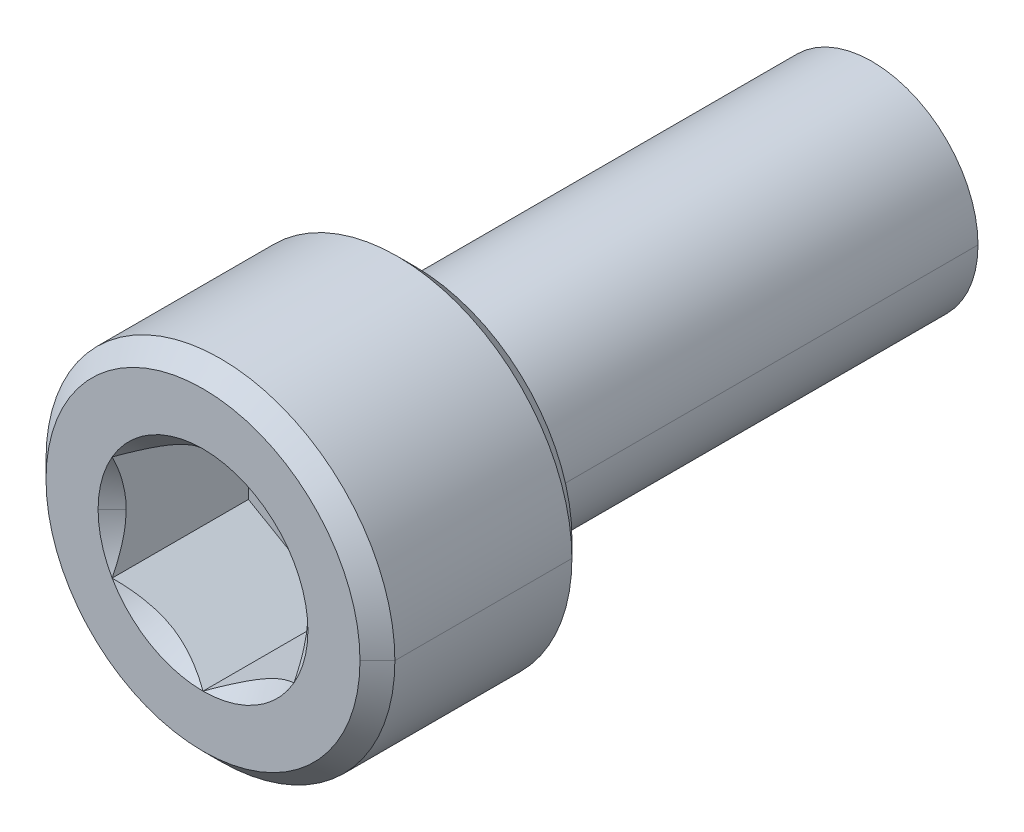
ISO-10303-21;
HEADER;
FILE_DESCRIPTION(('STEP AP214'),'2;1');
FILE_NAME('part.step','',(''),(''),'','','');
FILE_SCHEMA(('AUTOMOTIVE_DESIGN { 1 0 10303 214 1 1 1 1 }'));
ENDSEC;
DATA;
#1=APPLICATION_CONTEXT('core data for automotive mechanical design processes');
#2=APPLICATION_PROTOCOL_DEFINITION('international standard','automotive_design',2000,#1);
#3=PRODUCT_CONTEXT('',#1,'mechanical');
#4=PRODUCT('Part','Part','',(#3));
#5=PRODUCT_RELATED_PRODUCT_CATEGORY('part','',(#4));
#6=PRODUCT_DEFINITION_FORMATION('','',#4);
#7=PRODUCT_DEFINITION_CONTEXT('part definition',#1,'design');
#8=PRODUCT_DEFINITION('design','',#6,#7);
#9=PRODUCT_DEFINITION_SHAPE('','',#8);
#10=(LENGTH_UNIT() NAMED_UNIT(*) SI_UNIT(.MILLI.,.METRE.));
#11=(NAMED_UNIT(*) PLANE_ANGLE_UNIT() SI_UNIT($,.RADIAN.));
#12=(NAMED_UNIT(*) SI_UNIT($,.STERADIAN.) SOLID_ANGLE_UNIT());
#13=UNCERTAINTY_MEASURE_WITH_UNIT(LENGTH_MEASURE(1.E-05),#10,'distance_accuracy_value','');
#14=(GEOMETRIC_REPRESENTATION_CONTEXT(3) GLOBAL_UNCERTAINTY_ASSIGNED_CONTEXT((#13)) GLOBAL_UNIT_ASSIGNED_CONTEXT((#10,
#11,#12)) REPRESENTATION_CONTEXT('',''));
#15=CARTESIAN_POINT('',(0.,0.,0.));
#16=DIRECTION('',(0.,0.,1.));
#17=DIRECTION('',(1.,0.,0.));
#18=AXIS2_PLACEMENT_3D('',#15,#16,#17);
#19=CARTESIAN_POINT('',(-10.3682102585368,0.,2.8429));
#20=DIRECTION('',(0.,0.,1.));
#21=DIRECTION('',(-1.,0.,0.));
#22=AXIS2_PLACEMENT_3D('',#19,#20,#21);
#23=CONICAL_SURFACE('',#22,3.429,0.785398163397452);
#24=DIRECTION('',(0.70710678118655,0.,0.707106781186545));
#25=VECTOR('',#24,1.);
#26=CARTESIAN_POINT('',(-6.9392102585368,0.,2.8429));
#27=LINE('',#26,#25);
#28=CARTESIAN_POINT('',(-7.2821102585268,0.,2.50000000001));
#29=VERTEX_POINT('',#28);
#30=CARTESIAN_POINT('',(-6.9392102585268,0.,2.84290000001));
#31=VERTEX_POINT('',#30);
#32=EDGE_CURVE('E230',#29,#31,#27,.T.);
#33=ORIENTED_EDGE('',*,*,#32,.F.);
#34=CARTESIAN_POINT('',(-10.3682102585368,0.,2.50000000001));
#35=DIRECTION('',(0.,0.,-1.));
#36=DIRECTION('',(-1.,0.,0.));
#37=AXIS2_PLACEMENT_3D('',#34,#35,#36);
#38=CIRCLE('',#37,3.08610000001);
#39=CARTESIAN_POINT('',(-13.4543102585468,0.,2.50000000001));
#40=VERTEX_POINT('',#39);
#41=EDGE_CURVE('E235',#40,#29,#38,.T.);
#42=ORIENTED_EDGE('',*,*,#41,.F.);
#43=DIRECTION('',(-0.70710678118655,0.,0.707106781186545));
#44=VECTOR('',#43,1.);
#45=CARTESIAN_POINT('',(-13.7972102585368,0.,2.8429));
#46=LINE('',#45,#44);
#47=CARTESIAN_POINT('',(-13.7972102585468,0.,2.84290000001));
#48=VERTEX_POINT('',#47);
#49=EDGE_CURVE('E249',#40,#48,#46,.T.);
#50=ORIENTED_EDGE('',*,*,#49,.T.);
#51=CARTESIAN_POINT('',(-10.3682102585368,0.,2.84290000001));
#52=DIRECTION('',(0.,0.,1.));
#53=DIRECTION('',(-1.,0.,0.));
#54=AXIS2_PLACEMENT_3D('',#51,#52,#53);
#55=CIRCLE('',#54,3.42900000001);
#56=EDGE_CURVE('E11',#31,#48,#55,.T.);
#57=ORIENTED_EDGE('',*,*,#56,.F.);
#58=EDGE_LOOP('',(#33,#42,#50,#57));
#59=FACE_BOUND('',#58,.T.);
#60=ADVANCED_FACE('F17',(#59),#23,.T.);
#61=CARTESIAN_POINT('',(-10.3682102585368,0.,6.6656));
#62=DIRECTION('',(0.,0.,-1.));
#63=DIRECTION('',(1.,0.,0.));
#64=AXIS2_PLACEMENT_3D('',#61,#62,#63);
#65=CONICAL_SURFACE('',#64,3.0861,0.785398163397446);
#66=DIRECTION('',(-0.707106781186546,0.,-0.707106781186549));
#67=VECTOR('',#66,1.);
#68=CARTESIAN_POINT('',(-13.4543102585368,0.,6.6656));
#69=LINE('',#68,#67);
#70=CARTESIAN_POINT('',(-13.4543102585468,0.,6.66560000001));
#71=VERTEX_POINT('',#70);
#72=CARTESIAN_POINT('',(-13.7972102585468,0.,6.32270000001));
#73=VERTEX_POINT('',#72);
#74=EDGE_CURVE('E266',#71,#73,#69,.T.);
#75=ORIENTED_EDGE('',*,*,#74,.F.);
#76=CARTESIAN_POINT('',(-10.3682102585368,0.,6.66560000001));
#77=DIRECTION('',(0.,0.,1.));
#78=DIRECTION('',(-1.,0.,0.));
#79=AXIS2_PLACEMENT_3D('',#76,#77,#78);
#80=CIRCLE('',#79,3.08610000001001);
#81=CARTESIAN_POINT('',(-7.28211025852679,0.,6.66560000001));
#82=VERTEX_POINT('',#81);
#83=EDGE_CURVE('E262',#82,#71,#80,.T.);
#84=ORIENTED_EDGE('',*,*,#83,.F.);
#85=DIRECTION('',(0.707106781186546,0.,-0.707106781186549));
#86=VECTOR('',#85,1.);
#87=CARTESIAN_POINT('',(-7.2821102585368,0.,6.6656));
#88=LINE('',#87,#86);
#89=CARTESIAN_POINT('',(-6.9392102585268,0.,6.32270000001));
#90=VERTEX_POINT('',#89);
#91=EDGE_CURVE('E256',#82,#90,#88,.T.);
#92=ORIENTED_EDGE('',*,*,#91,.T.);
#93=CARTESIAN_POINT('',(-10.3682102585368,0.,6.32270000001));
#94=DIRECTION('',(0.,0.,-1.));
#95=DIRECTION('',(-1.,0.,0.));
#96=AXIS2_PLACEMENT_3D('',#93,#94,#95);
#97=CIRCLE('',#96,3.42900000001);
#98=EDGE_CURVE('E28',#73,#90,#97,.T.);
#99=ORIENTED_EDGE('',*,*,#98,.F.);
#100=EDGE_LOOP('',(#75,#84,#92,#99));
#101=FACE_BOUND('',#100,.T.);
#102=ADVANCED_FACE('F213',(#101),#65,.T.);
#103=CARTESIAN_POINT('',(-10.3682102585368,0.,6.6656));
#104=DIRECTION('',(0.,0.,1.));
#105=DIRECTION('',(-1.,0.,0.));
#106=AXIS2_PLACEMENT_3D('',#103,#104,#105);
#107=CONICAL_SURFACE('',#106,2.0622229927617,0.78539816339745);
#108=DIRECTION('',(-0.707106781186549,0.,0.707106781186546));
#109=VECTOR('',#108,1.);
#110=CARTESIAN_POINT('',(-12.4304332512985,0.,6.6656));
#111=LINE('',#110,#109);
#112=CARTESIAN_POINT('',(-12.1541477585368,0.,6.3893145072383));
#113=VERTEX_POINT('',#112);
#114=CARTESIAN_POINT('',(-12.4304332513085,0.,6.66560000001));
#115=VERTEX_POINT('',#114);
#116=EDGE_CURVE('E507',#113,#115,#111,.T.);
#117=ORIENTED_EDGE('',*,*,#116,.F.);
#118=CARTESIAN_POINT('',(-12.1541477585368,1.03111149638085,6.6656));
#119=CARTESIAN_POINT('',(-12.1541477585368,0.478540510842383,6.3893145072383));
#120=CARTESIAN_POINT('',(-12.1541477585368,0.,6.3893145072383));
#121=B_SPLINE_CURVE_WITH_KNOTS('',2,(#118,#119,#120),.UNSPECIFIED.,.F.,.F.,(3,3),(0.,1.),.UNSPECIFIED.);
#122=CARTESIAN_POINT('',(-12.1541477585368,1.03111149638085,6.6656));
#123=VERTEX_POINT('',#122);
#124=EDGE_CURVE('E325',#123,#113,#121,.T.);
#125=ORIENTED_EDGE('',*,*,#124,.F.);
#126=CARTESIAN_POINT('',(-10.3682102585368,0.,6.66560000001));
#127=DIRECTION('',(0.,0.,1.));
#128=DIRECTION('',(-1.,0.,0.));
#129=AXIS2_PLACEMENT_3D('',#126,#127,#128);
#130=CIRCLE('',#129,2.0622229927717);
#131=EDGE_CURVE('E331',#123,#115,#130,.T.);
#132=ORIENTED_EDGE('',*,*,#131,.T.);
#133=EDGE_LOOP('',(#117,#125,#132));
#134=FACE_BOUND('',#133,.T.);
#135=ADVANCED_FACE('F206',(#134),#107,.F.);
#136=CARTESIAN_POINT('',(-10.3682102585368,0.,6.6656));
#137=DIRECTION('',(0.,0.,-1.));
#138=DIRECTION('',(1.,0.,0.));
#139=AXIS2_PLACEMENT_3D('',#136,#137,#138);
#140=CYLINDRICAL_SURFACE('',#139,3.429);
#141=DIRECTION('',(0.,0.,-1.));
#142=VECTOR('',#141,1.);
#143=CARTESIAN_POINT('',(-13.7972102585368,0.,6.6656));
#144=LINE('',#143,#142);
#145=EDGE_CURVE('E280',#73,#48,#144,.T.);
#146=ORIENTED_EDGE('',*,*,#145,.F.);
#147=ORIENTED_EDGE('',*,*,#98,.T.);
#148=DIRECTION('',(0.,0.,-1.));
#149=VECTOR('',#148,1.);
#150=CARTESIAN_POINT('',(-6.9392102585368,0.,6.6656));
#151=LINE('',#150,#149);
#152=EDGE_CURVE('E284',#90,#31,#151,.T.);
#153=ORIENTED_EDGE('',*,*,#152,.T.);
#154=ORIENTED_EDGE('',*,*,#56,.T.);
#155=EDGE_LOOP('',(#146,#147,#153,#154));
#156=FACE_BOUND('',#155,.T.);
#157=ADVANCED_FACE('F203',(#156),#140,.T.);
#158=CARTESIAN_POINT('',(-10.3682102585368,0.,-7.025));
#159=DIRECTION('',(0.,0.,1.));
#160=DIRECTION('',(-1.,0.,0.));
#161=AXIS2_PLACEMENT_3D('',#158,#159,#160);
#162=CONICAL_SURFACE('',#161,1.31324425180957,0.959931088596884);
#163=DIRECTION('',(0.819152044288993,0.,0.573576436351044));
#164=VECTOR('',#163,1.);
#165=CARTESIAN_POINT('',(-9.05496600672723,0.,-7.025));
#166=LINE('',#165,#164);
#167=CARTESIAN_POINT('',(-9.05496600671723,0.,-7.025));
#168=VERTEX_POINT('',#167);
#169=CARTESIAN_POINT('',(-8.2854102585268,0.,-6.48615126403445));
#170=VERTEX_POINT('',#169);
#171=EDGE_CURVE('E299',#168,#170,#166,.T.);
#172=ORIENTED_EDGE('',*,*,#171,.F.);
#173=CARTESIAN_POINT('',(-10.3682102585368,0.,-7.025));
#174=DIRECTION('',(0.,0.,-1.));
#175=DIRECTION('',(1.,0.,0.));
#176=AXIS2_PLACEMENT_3D('',#173,#174,#175);
#177=CIRCLE('',#176,1.31324425181957);
#178=CARTESIAN_POINT('',(-11.6814545103564,0.,-7.025));
#179=VERTEX_POINT('',#178);
#180=EDGE_CURVE('E327',#179,#168,#177,.T.);
#181=ORIENTED_EDGE('',*,*,#180,.F.);
#182=DIRECTION('',(-0.819152044288993,0.,0.573576436351044));
#183=VECTOR('',#182,1.);
#184=CARTESIAN_POINT('',(-11.6814545103464,0.,-7.025));
#185=LINE('',#184,#183);
#186=CARTESIAN_POINT('',(-12.4510102585468,0.,-6.48615126403445));
#187=VERTEX_POINT('',#186);
#188=EDGE_CURVE('E298',#179,#187,#185,.T.);
#189=ORIENTED_EDGE('',*,*,#188,.T.);
#190=CARTESIAN_POINT('',(-10.3682102585368,0.,-6.48615126403445));
#191=DIRECTION('',(0.,0.,-1.));
#192=DIRECTION('',(1.,0.,0.));
#193=AXIS2_PLACEMENT_3D('',#190,#191,#192);
#194=CIRCLE('',#193,2.08280000001);
#195=EDGE_CURVE('E330',#187,#170,#194,.T.);
#196=ORIENTED_EDGE('',*,*,#195,.T.);
#197=EDGE_LOOP('',(#172,#181,#189,#196));
#198=FACE_BOUND('',#197,.T.);
#199=ADVANCED_FACE('F201',(#198),#162,.T.);
#200=CARTESIAN_POINT('',(-10.3682102585368,0.,2.5));
#201=DIRECTION('',(0.,0.,-1.));
#202=DIRECTION('',(1.,0.,0.));
#203=AXIS2_PLACEMENT_3D('',#200,#201,#202);
#204=CYLINDRICAL_SURFACE('',#203,2.0828);
#205=DIRECTION('',(0.,0.,-1.));
#206=VECTOR('',#205,1.);
#207=CARTESIAN_POINT('',(-12.4510102585368,0.,2.5));
#208=LINE('',#207,#206);
#209=CARTESIAN_POINT('',(-12.4510102585468,0.,2.50000000001));
#210=VERTEX_POINT('',#209);
#211=EDGE_CURVE('E313',#210,#187,#208,.T.);
#212=ORIENTED_EDGE('',*,*,#211,.F.);
#213=CARTESIAN_POINT('',(-10.3682102585368,0.,2.50000000001));
#214=DIRECTION('',(0.,0.,-1.));
#215=DIRECTION('',(-1.,0.,0.));
#216=AXIS2_PLACEMENT_3D('',#213,#214,#215);
#217=CIRCLE('',#216,2.08280000001);
#218=CARTESIAN_POINT('',(-8.2854102585268,0.,2.50000000001));
#219=VERTEX_POINT('',#218);
#220=EDGE_CURVE('E258',#210,#219,#217,.T.);
#221=ORIENTED_EDGE('',*,*,#220,.T.);
#222=DIRECTION('',(0.,0.,-1.));
#223=VECTOR('',#222,1.);
#224=CARTESIAN_POINT('',(-8.2854102585368,0.,2.5));
#225=LINE('',#224,#223);
#226=EDGE_CURVE('E317',#219,#170,#225,.T.);
#227=ORIENTED_EDGE('',*,*,#226,.T.);
#228=ORIENTED_EDGE('',*,*,#195,.F.);
#229=EDGE_LOOP('',(#212,#221,#227,#228));
#230=FACE_BOUND('',#229,.T.);
#231=ADVANCED_FACE('F199',(#230),#204,.T.);
#232=CARTESIAN_POINT('',(-10.3682102585368,0.,-7.025));
#233=DIRECTION('',(0.,0.,-1.));
#234=DIRECTION('',(0.,-1.,0.));
#235=AXIS2_PLACEMENT_3D('',#232,#233,#234);
#236=PLANE('',#235);
#237=ORIENTED_EDGE('',*,*,#180,.T.);
#238=CARTESIAN_POINT('',(-10.3682102585368,0.,-7.025));
#239=DIRECTION('',(0.,0.,-1.));
#240=DIRECTION('',(1.,0.,0.));
#241=AXIS2_PLACEMENT_3D('',#238,#239,#240);
#242=CIRCLE('',#241,1.31324425181957);
#243=EDGE_CURVE('E293',#168,#179,#242,.T.);
#244=ORIENTED_EDGE('',*,*,#243,.T.);
#245=EDGE_LOOP('',(#237,#244));
#246=FACE_BOUND('',#245,.T.);
#247=ADVANCED_FACE('F195',(#246),#236,.T.);
#248=CARTESIAN_POINT('',(-10.3682102585368,0.,6.6656));
#249=DIRECTION('',(0.,0.,1.));
#250=DIRECTION('',(1.,0.,0.));
#251=AXIS2_PLACEMENT_3D('',#248,#249,#250);
#252=PLANE('',#251);
#253=CARTESIAN_POINT('',(-10.3682102585368,0.,6.66560000001));
#254=DIRECTION('',(0.,0.,1.));
#255=DIRECTION('',(-1.,0.,0.));
#256=AXIS2_PLACEMENT_3D('',#253,#254,#255);
#257=CIRCLE('',#256,2.0622229927717);
#258=CARTESIAN_POINT('',(-12.1541477585368,-1.03111149638085,6.6656));
#259=VERTEX_POINT('',#258);
#260=CARTESIAN_POINT('',(-10.3682102585368,-2.0622229927617,6.6656));
#261=VERTEX_POINT('',#260);
#262=EDGE_CURVE('E335',#259,#261,#257,.T.);
#263=ORIENTED_EDGE('',*,*,#262,.F.);
#264=CARTESIAN_POINT('',(-10.3682102585368,0.,6.66560000001));
#265=DIRECTION('',(0.,0.,1.));
#266=DIRECTION('',(-1.,0.,0.));
#267=AXIS2_PLACEMENT_3D('',#264,#265,#266);
#268=CIRCLE('',#267,2.0622229927717);
#269=EDGE_CURVE('E285',#115,#259,#268,.T.);
#270=ORIENTED_EDGE('',*,*,#269,.F.);
#271=ORIENTED_EDGE('',*,*,#131,.F.);
#272=CARTESIAN_POINT('',(-10.3682102585368,0.,6.66560000001));
#273=DIRECTION('',(0.,0.,1.));
#274=DIRECTION('',(-1.,0.,0.));
#275=AXIS2_PLACEMENT_3D('',#272,#273,#274);
#276=CIRCLE('',#275,2.0622229927717);
#277=CARTESIAN_POINT('',(-10.3682102585368,2.0622229927617,6.6656));
#278=VERTEX_POINT('',#277);
#279=EDGE_CURVE('E431',#278,#123,#276,.T.);
#280=ORIENTED_EDGE('',*,*,#279,.F.);
#281=CARTESIAN_POINT('',(-10.3682102585368,0.,6.66560000001));
#282=DIRECTION('',(0.,0.,1.));
#283=DIRECTION('',(-1.,0.,0.));
#284=AXIS2_PLACEMENT_3D('',#281,#282,#283);
#285=CIRCLE('',#284,2.0622229927717);
#286=CARTESIAN_POINT('',(-8.58227275853682,1.03111149638085,6.6656));
#287=VERTEX_POINT('',#286);
#288=EDGE_CURVE('E437',#287,#278,#285,.T.);
#289=ORIENTED_EDGE('',*,*,#288,.F.);
#290=CARTESIAN_POINT('',(-10.3682102585368,0.,6.66560000001));
#291=DIRECTION('',(0.,0.,1.));
#292=DIRECTION('',(-1.,0.,0.));
#293=AXIS2_PLACEMENT_3D('',#290,#291,#292);
#294=CIRCLE('',#293,2.0622229927717);
#295=CARTESIAN_POINT('',(-8.58227275853682,-1.03111149638085,6.6656));
#296=VERTEX_POINT('',#295);
#297=EDGE_CURVE('E423',#296,#287,#294,.T.);
#298=ORIENTED_EDGE('',*,*,#297,.F.);
#299=CARTESIAN_POINT('',(-10.3682102585368,0.,6.66560000001));
#300=DIRECTION('',(0.,0.,1.));
#301=DIRECTION('',(-1.,0.,0.));
#302=AXIS2_PLACEMENT_3D('',#299,#300,#301);
#303=CIRCLE('',#302,2.0622229927717);
#304=EDGE_CURVE('E41',#261,#296,#303,.T.);
#305=ORIENTED_EDGE('',*,*,#304,.F.);
#306=EDGE_LOOP('',(#263,#270,#271,#280,#289,#298,#305));
#307=FACE_BOUND('',#306,.T.);
#308=ORIENTED_EDGE('',*,*,#83,.T.);
#309=CARTESIAN_POINT('',(-10.3682102585368,0.,6.66560000001));
#310=DIRECTION('',(0.,0.,1.));
#311=DIRECTION('',(-1.,0.,0.));
#312=AXIS2_PLACEMENT_3D('',#309,#310,#311);
#313=CIRCLE('',#312,3.08610000001001);
#314=EDGE_CURVE('E271',#71,#82,#313,.T.);
#315=ORIENTED_EDGE('',*,*,#314,.T.);
#316=EDGE_LOOP('',(#308,#315));
#317=FACE_BOUND('',#316,.T.);
#318=ADVANCED_FACE('F191',(#307,#317),#252,.T.);
#319=CARTESIAN_POINT('',(-10.3682102585368,0.,2.5));
#320=DIRECTION('',(0.,0.,1.));
#321=DIRECTION('',(1.,0.,0.));
#322=AXIS2_PLACEMENT_3D('',#319,#320,#321);
#323=PLANE('',#322);
#324=CARTESIAN_POINT('',(-10.3682102585368,0.,2.50000000001));
#325=DIRECTION('',(0.,0.,-1.));
#326=DIRECTION('',(-1.,0.,0.));
#327=AXIS2_PLACEMENT_3D('',#324,#325,#326);
#328=CIRCLE('',#327,2.08280000001);
#329=EDGE_CURVE('E309',#219,#210,#328,.T.);
#330=ORIENTED_EDGE('',*,*,#329,.F.);
#331=ORIENTED_EDGE('',*,*,#220,.F.);
#332=EDGE_LOOP('',(#330,#331));
#333=FACE_BOUND('',#332,.T.);
#334=ORIENTED_EDGE('',*,*,#41,.T.);
#335=CARTESIAN_POINT('',(-10.3682102585368,0.,2.50000000001));
#336=DIRECTION('',(0.,0.,-1.));
#337=DIRECTION('',(-1.,0.,0.));
#338=AXIS2_PLACEMENT_3D('',#335,#336,#337);
#339=CIRCLE('',#338,3.08610000001);
#340=EDGE_CURVE('E245',#29,#40,#339,.T.);
#341=ORIENTED_EDGE('',*,*,#340,.T.);
#342=EDGE_LOOP('',(#334,#341));
#343=FACE_BOUND('',#342,.T.);
#344=ADVANCED_FACE('F186',(#333,#343),#323,.F.);
#345=CARTESIAN_POINT('',(-10.3682102585368,0.,6.6656));
#346=DIRECTION('',(0.,0.,1.));
#347=DIRECTION('',(-1.,0.,0.));
#348=AXIS2_PLACEMENT_3D('',#345,#346,#347);
#349=CONICAL_SURFACE('',#348,2.0622229927617,0.78539816339745);
#350=ORIENTED_EDGE('',*,*,#304,.T.);
#351=CARTESIAN_POINT('',(-10.3682102585368,-2.0622229927617,6.6656));
#352=CARTESIAN_POINT('',(-9.89229659632552,-1.787454111773,6.39083111904805));
#353=CARTESIAN_POINT('',(-9.47853058678821,-1.54856619478511,6.38931854547226));
#354=CARTESIAN_POINT('',(-9.06343455066039,-1.30891038658717,6.38780110981735));
#355=CARTESIAN_POINT('',(-8.58227275853681,-1.03111149638086,6.6656));
#356=B_SPLINE_CURVE_WITH_KNOTS('',2,(#351,#352,#353,#354,#355),.UNSPECIFIED.,.F.,.F.,(3,2,3),
(0.,0.5,1.),.UNSPECIFIED.);
#357=EDGE_CURVE('E94',#261,#296,#356,.T.);
#358=ORIENTED_EDGE('',*,*,#357,.F.);
#359=EDGE_LOOP('',(#350,#358));
#360=FACE_BOUND('',#359,.T.);
#361=ADVANCED_FACE('F175',(#360),#349,.F.);
#362=CARTESIAN_POINT('',(-10.3682102585368,0.,6.6656));
#363=DIRECTION('',(0.,0.,1.));
#364=DIRECTION('',(-1.,0.,0.));
#365=AXIS2_PLACEMENT_3D('',#362,#363,#364);
#366=CONICAL_SURFACE('',#365,2.0622229927617,0.78539816339745);
#367=ORIENTED_EDGE('',*,*,#297,.T.);
#368=CARTESIAN_POINT('',(-8.58227275853682,-1.03111149638085,6.6656));
#369=CARTESIAN_POINT('',(-8.58227275853682,-0.479143676750115,6.38961609020014));
#370=CARTESIAN_POINT('',(-8.58227275853682,-0.000112420350076173,6.3893145107866));
#371=CARTESIAN_POINT('',(-8.58227275853682,0.47793859334111,6.38901354849567));
#372=CARTESIAN_POINT('',(-8.58227275853682,1.03111149638085,6.6656));
#373=B_SPLINE_CURVE_WITH_KNOTS('',2,(#368,#369,#370,#371,#372),.UNSPECIFIED.,.F.,.F.,(3,2,3),
(0.,0.5,1.),.UNSPECIFIED.);
#374=EDGE_CURVE('E95',#296,#287,#373,.T.);
#375=ORIENTED_EDGE('',*,*,#374,.F.);
#376=EDGE_LOOP('',(#367,#375));
#377=FACE_BOUND('',#376,.T.);
#378=ADVANCED_FACE('F185',(#377),#366,.F.);
#379=CARTESIAN_POINT('',(-10.3682102585368,0.,6.6656));
#380=DIRECTION('',(0.,0.,1.));
#381=DIRECTION('',(-1.,0.,0.));
#382=AXIS2_PLACEMENT_3D('',#379,#380,#381);
#383=CONICAL_SURFACE('',#382,2.0622229927617,0.78539816339745);
#384=ORIENTED_EDGE('',*,*,#288,.T.);
#385=CARTESIAN_POINT('',(-8.58227275853682,1.03111149638085,6.6656));
#386=CARTESIAN_POINT('',(-9.0581864207291,1.30588037735858,6.39083111904761));
#387=CARTESIAN_POINT('',(-9.47195243027908,1.54476829435378,6.38931854547226));
#388=CARTESIAN_POINT('',(-9.88704846639214,1.78442410254321,6.38780110981788));
#389=CARTESIAN_POINT('',(-10.3682102585368,2.06222299276169,6.6656));
#390=B_SPLINE_CURVE_WITH_KNOTS('',2,(#385,#386,#387,#388,#389),.UNSPECIFIED.,.F.,.F.,(3,2,3),
(0.,0.5,1.),.UNSPECIFIED.);
#391=EDGE_CURVE('E107',#287,#278,#390,.T.);
#392=ORIENTED_EDGE('',*,*,#391,.F.);
#393=EDGE_LOOP('',(#384,#392));
#394=FACE_BOUND('',#393,.T.);
#395=ADVANCED_FACE('F746',(#394),#383,.F.);
#396=CARTESIAN_POINT('',(-10.3682102585368,0.,6.6656));
#397=DIRECTION('',(0.,0.,1.));
#398=DIRECTION('',(-1.,0.,0.));
#399=AXIS2_PLACEMENT_3D('',#396,#397,#398);
#400=CONICAL_SURFACE('',#399,2.0622229927617,0.78539816339745);
#401=ORIENTED_EDGE('',*,*,#279,.T.);
#402=CARTESIAN_POINT('',(-10.3682102585368,2.0622229927617,6.6656));
#403=CARTESIAN_POINT('',(-10.8441239207495,1.78745411177216,6.39083111904864));
#404=CARTESIAN_POINT('',(-11.2578899302854,1.54856619478512,6.38931854547226));
#405=CARTESIAN_POINT('',(-11.6729859664124,1.30891038658766,6.38780110981677));
#406=CARTESIAN_POINT('',(-12.1541477585368,1.03111149638085,6.6656));
#407=B_SPLINE_CURVE_WITH_KNOTS('',2,(#402,#403,#404,#405,#406),.UNSPECIFIED.,.F.,.F.,(3,2,3),
(0.,0.5,1.),.UNSPECIFIED.);
#408=EDGE_CURVE('E122',#278,#123,#407,.T.);
#409=ORIENTED_EDGE('',*,*,#408,.F.);
#410=EDGE_LOOP('',(#401,#409));
#411=FACE_BOUND('',#410,.T.);
#412=ADVANCED_FACE('F756',(#411),#400,.F.);
#413=CARTESIAN_POINT('',(-10.3682102585368,0.,6.6656));
#414=DIRECTION('',(0.,0.,1.));
#415=DIRECTION('',(-1.,0.,0.));
#416=AXIS2_PLACEMENT_3D('',#413,#414,#415);
#417=CONICAL_SURFACE('',#416,2.0622229927617,0.78539816339745);
#418=ORIENTED_EDGE('',*,*,#262,.T.);
#419=CARTESIAN_POINT('',(-12.1541477585368,-1.03111149638085,6.6656));
#420=CARTESIAN_POINT('',(-11.6782340963448,-1.30588037735842,6.39083111904781));
#421=CARTESIAN_POINT('',(-11.2644680867946,-1.54476829435376,6.38931854547227));
#422=CARTESIAN_POINT('',(-10.8493720506846,-1.78442410254143,6.38780110981772));
#423=CARTESIAN_POINT('',(-10.3682102585368,-2.0622229927617,6.6656));
#424=B_SPLINE_CURVE_WITH_KNOTS('',2,(#419,#420,#421,#422,#423),.UNSPECIFIED.,.F.,.F.,(3,2,3),
(0.,0.5,1.),.UNSPECIFIED.);
#425=EDGE_CURVE('E427',#259,#261,#424,.T.);
#426=ORIENTED_EDGE('',*,*,#425,.F.);
#427=EDGE_LOOP('',(#418,#426));
#428=FACE_BOUND('',#427,.T.);
#429=ADVANCED_FACE('F154',(#428),#417,.F.);
#430=CARTESIAN_POINT('',(-8.58227275853682,-3.09333448914254,3.98669375));
#431=DIRECTION('',(0.,0.,1.));
#432=DIRECTION('',(1.,0.,0.));
#433=AXIS2_PLACEMENT_3D('',#430,#431,#432);
#434=PLANE('',#433);
#435=DIRECTION('',(0.866025403784438,-0.5,0.));
#436=VECTOR('',#435,1.);
#437=CARTESIAN_POINT('',(-12.1541477585468,-1.03111149639085,3.98669375001));
#438=LINE('',#437,#436);
#439=CARTESIAN_POINT('',(-12.1541477585368,-1.03111149638085,3.98669375));
#440=VERTEX_POINT('',#439);
#441=CARTESIAN_POINT('',(-10.3682102585368,-2.0622229927617,3.98669375));
#442=VERTEX_POINT('',#441);
#443=EDGE_CURVE('E286',#440,#442,#438,.T.);
#444=ORIENTED_EDGE('',*,*,#443,.T.);
#445=DIRECTION('',(0.866025403784438,0.5,0.));
#446=VECTOR('',#445,1.);
#447=CARTESIAN_POINT('',(-10.3682102585368,-2.0622229927717,3.98669375001));
#448=LINE('',#447,#446);
#449=CARTESIAN_POINT('',(-8.58227275853682,-1.03111149638085,3.98669375));
#450=VERTEX_POINT('',#449);
#451=EDGE_CURVE('E55',#442,#450,#448,.T.);
#452=ORIENTED_EDGE('',*,*,#451,.T.);
#453=DIRECTION('',(0.,1.,0.));
#454=VECTOR('',#453,1.);
#455=CARTESIAN_POINT('',(-8.58227275852682,-1.03111149639085,3.98669375001));
#456=LINE('',#455,#454);
#457=CARTESIAN_POINT('',(-8.58227275853682,1.03111149638085,3.98669375));
#458=VERTEX_POINT('',#457);
#459=EDGE_CURVE('E84',#450,#458,#456,.T.);
#460=ORIENTED_EDGE('',*,*,#459,.T.);
#461=DIRECTION('',(-0.866025403784438,0.5,0.));
#462=VECTOR('',#461,1.);
#463=CARTESIAN_POINT('',(-8.58227275852682,1.03111149639085,3.98669375001));
#464=LINE('',#463,#462);
#465=CARTESIAN_POINT('',(-10.3682102585368,2.0622229927617,3.98669375));
#466=VERTEX_POINT('',#465);
#467=EDGE_CURVE('E87',#458,#466,#464,.T.);
#468=ORIENTED_EDGE('',*,*,#467,.T.);
#469=DIRECTION('',(-0.866025403784438,-0.5,0.));
#470=VECTOR('',#469,1.);
#471=CARTESIAN_POINT('',(-10.3682102585368,2.0622229927717,3.98669375001));
#472=LINE('',#471,#470);
#473=CARTESIAN_POINT('',(-12.1541477585368,1.03111149638085,3.98669375));
#474=VERTEX_POINT('',#473);
#475=EDGE_CURVE('E115',#466,#474,#472,.T.);
#476=ORIENTED_EDGE('',*,*,#475,.T.);
#477=DIRECTION('',(0.,-1.,0.));
#478=VECTOR('',#477,1.);
#479=CARTESIAN_POINT('',(-12.1541477585468,1.03111149639085,3.98669375001));
#480=LINE('',#479,#478);
#481=EDGE_CURVE('E322',#474,#440,#480,.T.);
#482=ORIENTED_EDGE('',*,*,#481,.T.);
#483=EDGE_LOOP('',(#444,#452,#460,#468,#476,#482));
#484=FACE_BOUND('',#483,.T.);
#485=ADVANCED_FACE('F86',(#484),#434,.T.);
#486=CARTESIAN_POINT('',(-10.3682102585368,-2.0622229927617,3.98669375));
#487=DIRECTION('',(0.5,-0.866025403784439,0.));
#488=DIRECTION('',(0.,0.,-1.));
#489=AXIS2_PLACEMENT_3D('',#486,#487,#488);
#490=PLANE('',#489);
#491=DIRECTION('',(0.,0.,1.));
#492=VECTOR('',#491,1.);
#493=CARTESIAN_POINT('',(-10.3682102585368,-2.0622229927717,3.98669375001));
#494=LINE('',#493,#492);
#495=EDGE_CURVE('E290',#442,#261,#494,.T.);
#496=ORIENTED_EDGE('',*,*,#495,.T.);
#497=ORIENTED_EDGE('',*,*,#357,.T.);
#498=DIRECTION('',(0.,0.,1.));
#499=VECTOR('',#498,1.);
#500=CARTESIAN_POINT('',(-8.58227275852682,-1.03111149639085,3.98669375001));
#501=LINE('',#500,#499);
#502=EDGE_CURVE('E106',#450,#296,#501,.T.);
#503=ORIENTED_EDGE('',*,*,#502,.F.);
#504=ORIENTED_EDGE('',*,*,#451,.F.);
#505=EDGE_LOOP('',(#496,#497,#503,#504));
#506=FACE_BOUND('',#505,.T.);
#507=ADVANCED_FACE('F149',(#506),#490,.F.);
#508=CARTESIAN_POINT('',(-8.58227275853682,-1.03111149638085,3.98669375));
#509=DIRECTION('',(1.,0.,0.));
#510=DIRECTION('',(0.,1.,0.));
#511=AXIS2_PLACEMENT_3D('',#508,#509,#510);
#512=PLANE('',#511);
#513=ORIENTED_EDGE('',*,*,#502,.T.);
#514=ORIENTED_EDGE('',*,*,#374,.T.);
#515=DIRECTION('',(0.,0.,1.));
#516=VECTOR('',#515,1.);
#517=CARTESIAN_POINT('',(-8.58227275852682,1.03111149639085,3.98669375001));
#518=LINE('',#517,#516);
#519=EDGE_CURVE('E102',#458,#287,#518,.T.);
#520=ORIENTED_EDGE('',*,*,#519,.F.);
#521=ORIENTED_EDGE('',*,*,#459,.F.);
#522=EDGE_LOOP('',(#513,#514,#520,#521));
#523=FACE_BOUND('',#522,.T.);
#524=ADVANCED_FACE('F110',(#523),#512,.F.);
#525=CARTESIAN_POINT('',(-8.58227275853682,1.03111149638085,3.98669375));
#526=DIRECTION('',(0.5,0.866025403784439,0.));
#527=DIRECTION('',(0.,0.,-1.));
#528=AXIS2_PLACEMENT_3D('',#525,#526,#527);
#529=PLANE('',#528);
#530=ORIENTED_EDGE('',*,*,#519,.T.);
#531=ORIENTED_EDGE('',*,*,#391,.T.);
#532=DIRECTION('',(0.,0.,1.));
#533=VECTOR('',#532,1.);
#534=CARTESIAN_POINT('',(-10.3682102585368,2.0622229927717,3.98669375001));
#535=LINE('',#534,#533);
#536=EDGE_CURVE('E104',#466,#278,#535,.T.);
#537=ORIENTED_EDGE('',*,*,#536,.F.);
#538=ORIENTED_EDGE('',*,*,#467,.F.);
#539=EDGE_LOOP('',(#530,#531,#537,#538));
#540=FACE_BOUND('',#539,.T.);
#541=ADVANCED_FACE('F100',(#540),#529,.F.);
#542=CARTESIAN_POINT('',(-10.3682102585368,2.0622229927617,3.98669375));
#543=DIRECTION('',(-0.5,0.866025403784439,0.));
#544=DIRECTION('',(0.,0.,1.));
#545=AXIS2_PLACEMENT_3D('',#542,#543,#544);
#546=PLANE('',#545);
#547=ORIENTED_EDGE('',*,*,#536,.T.);
#548=ORIENTED_EDGE('',*,*,#408,.T.);
#549=DIRECTION('',(0.,0.,1.));
#550=VECTOR('',#549,1.);
#551=CARTESIAN_POINT('',(-12.1541477585468,1.03111149639085,3.98669375001));
#552=LINE('',#551,#550);
#553=EDGE_CURVE('E289',#474,#123,#552,.T.);
#554=ORIENTED_EDGE('',*,*,#553,.F.);
#555=ORIENTED_EDGE('',*,*,#475,.F.);
#556=EDGE_LOOP('',(#547,#548,#554,#555));
#557=FACE_BOUND('',#556,.T.);
#558=ADVANCED_FACE('F146',(#557),#546,.F.);
#559=CARTESIAN_POINT('',(-12.1541477585368,1.03111149638085,3.98669375));
#560=DIRECTION('',(-1.,0.,0.));
#561=DIRECTION('',(0.,1.,0.));
#562=AXIS2_PLACEMENT_3D('',#559,#560,#561);
#563=PLANE('',#562);
#564=ORIENTED_EDGE('',*,*,#553,.T.);
#565=ORIENTED_EDGE('',*,*,#124,.T.);
#566=CARTESIAN_POINT('',(-12.1541477585368,0.,6.3893145072383));
#567=CARTESIAN_POINT('',(-12.1541477585368,-0.478540510842435,6.3893145072383));
#568=CARTESIAN_POINT('',(-12.1541477585368,-1.03111149638085,6.6656));
#569=B_SPLINE_CURVE_WITH_KNOTS('',2,(#566,#567,#568),.UNSPECIFIED.,.F.,.F.,(3,3),(0.,1.),.UNSPECIFIED.);
#570=EDGE_CURVE('E366',#113,#259,#569,.T.);
#571=ORIENTED_EDGE('',*,*,#570,.T.);
#572=DIRECTION('',(0.,0.,1.));
#573=VECTOR('',#572,1.);
#574=CARTESIAN_POINT('',(-12.1541477585468,-1.03111149639085,3.98669375001));
#575=LINE('',#574,#573);
#576=EDGE_CURVE('E321',#440,#259,#575,.T.);
#577=ORIENTED_EDGE('',*,*,#576,.F.);
#578=ORIENTED_EDGE('',*,*,#481,.F.);
#579=EDGE_LOOP('',(#564,#565,#571,#577,#578));
#580=FACE_BOUND('',#579,.T.);
#581=ADVANCED_FACE('F480',(#580),#563,.F.);
#582=CARTESIAN_POINT('',(-12.1541477585368,-1.03111149638085,3.98669375));
#583=DIRECTION('',(-0.5,-0.866025403784439,0.));
#584=DIRECTION('',(-0.866025403784439,0.5,0.));
#585=AXIS2_PLACEMENT_3D('',#582,#583,#584);
#586=PLANE('',#585);
#587=ORIENTED_EDGE('',*,*,#576,.T.);
#588=ORIENTED_EDGE('',*,*,#425,.T.);
#589=ORIENTED_EDGE('',*,*,#495,.F.);
#590=ORIENTED_EDGE('',*,*,#443,.F.);
#591=EDGE_LOOP('',(#587,#588,#589,#590));
#592=FACE_BOUND('',#591,.T.);
#593=ADVANCED_FACE('F483',(#592),#586,.F.);
#594=CARTESIAN_POINT('',(-10.3682102585368,0.,2.5));
#595=DIRECTION('',(0.,0.,-1.));
#596=DIRECTION('',(1.,0.,0.));
#597=AXIS2_PLACEMENT_3D('',#594,#595,#596);
#598=CYLINDRICAL_SURFACE('',#597,2.0828);
#599=ORIENTED_EDGE('',*,*,#329,.T.);
#600=ORIENTED_EDGE('',*,*,#211,.T.);
#601=CARTESIAN_POINT('',(-10.3682102585368,0.,-6.48615126403445));
#602=DIRECTION('',(0.,0.,-1.));
#603=DIRECTION('',(1.,0.,0.));
#604=AXIS2_PLACEMENT_3D('',#601,#602,#603);
#605=CIRCLE('',#604,2.08280000001);
#606=EDGE_CURVE('E294',#170,#187,#605,.T.);
#607=ORIENTED_EDGE('',*,*,#606,.F.);
#608=ORIENTED_EDGE('',*,*,#226,.F.);
#609=EDGE_LOOP('',(#599,#600,#607,#608));
#610=FACE_BOUND('',#609,.T.);
#611=ADVANCED_FACE('F478',(#610),#598,.T.);
#612=CARTESIAN_POINT('',(-10.3682102585368,0.,-7.025));
#613=DIRECTION('',(0.,0.,1.));
#614=DIRECTION('',(-1.,0.,0.));
#615=AXIS2_PLACEMENT_3D('',#612,#613,#614);
#616=CONICAL_SURFACE('',#615,1.31324425180957,0.959931088596884);
#617=ORIENTED_EDGE('',*,*,#243,.F.);
#618=ORIENTED_EDGE('',*,*,#171,.T.);
#619=ORIENTED_EDGE('',*,*,#606,.T.);
#620=ORIENTED_EDGE('',*,*,#188,.F.);
#621=EDGE_LOOP('',(#617,#618,#619,#620));
#622=FACE_BOUND('',#621,.T.);
#623=ADVANCED_FACE('F475',(#622),#616,.T.);
#624=CARTESIAN_POINT('',(-10.3682102585368,0.,6.6656));
#625=DIRECTION('',(0.,0.,-1.));
#626=DIRECTION('',(1.,0.,0.));
#627=AXIS2_PLACEMENT_3D('',#624,#625,#626);
#628=CYLINDRICAL_SURFACE('',#627,3.429);
#629=CARTESIAN_POINT('',(-10.3682102585368,0.,6.32270000001));
#630=DIRECTION('',(0.,0.,-1.));
#631=DIRECTION('',(-1.,0.,0.));
#632=AXIS2_PLACEMENT_3D('',#629,#630,#631);
#633=CIRCLE('',#632,3.42900000001);
#634=EDGE_CURVE('E270',#90,#73,#633,.T.);
#635=ORIENTED_EDGE('',*,*,#634,.T.);
#636=ORIENTED_EDGE('',*,*,#145,.T.);
#637=CARTESIAN_POINT('',(-10.3682102585368,0.,2.84290000001));
#638=DIRECTION('',(0.,0.,1.));
#639=DIRECTION('',(-1.,0.,0.));
#640=AXIS2_PLACEMENT_3D('',#637,#638,#639);
#641=CIRCLE('',#640,3.42900000001);
#642=EDGE_CURVE('E244',#48,#31,#641,.T.);
#643=ORIENTED_EDGE('',*,*,#642,.T.);
#644=ORIENTED_EDGE('',*,*,#152,.F.);
#645=EDGE_LOOP('',(#635,#636,#643,#644));
#646=FACE_BOUND('',#645,.T.);
#647=ADVANCED_FACE('F358',(#646),#628,.T.);
#648=CARTESIAN_POINT('',(-10.3682102585368,0.,6.6656));
#649=DIRECTION('',(0.,0.,1.));
#650=DIRECTION('',(-1.,0.,0.));
#651=AXIS2_PLACEMENT_3D('',#648,#649,#650);
#652=CONICAL_SURFACE('',#651,2.0622229927617,0.78539816339745);
#653=ORIENTED_EDGE('',*,*,#570,.F.);
#654=ORIENTED_EDGE('',*,*,#116,.T.);
#655=ORIENTED_EDGE('',*,*,#269,.T.);
#656=EDGE_LOOP('',(#653,#654,#655));
#657=FACE_BOUND('',#656,.T.);
#658=ADVANCED_FACE('F468',(#657),#652,.F.);
#659=CARTESIAN_POINT('',(-10.3682102585368,0.,6.6656));
#660=DIRECTION('',(0.,0.,-1.));
#661=DIRECTION('',(1.,0.,0.));
#662=AXIS2_PLACEMENT_3D('',#659,#660,#661);
#663=CONICAL_SURFACE('',#662,3.0861,0.785398163397446);
#664=ORIENTED_EDGE('',*,*,#314,.F.);
#665=ORIENTED_EDGE('',*,*,#74,.T.);
#666=ORIENTED_EDGE('',*,*,#634,.F.);
#667=ORIENTED_EDGE('',*,*,#91,.F.);
#668=EDGE_LOOP('',(#664,#665,#666,#667));
#669=FACE_BOUND('',#668,.T.);
#670=ADVANCED_FACE('F367',(#669),#663,.T.);
#671=CARTESIAN_POINT('',(-10.3682102585368,0.,2.8429));
#672=DIRECTION('',(0.,0.,1.));
#673=DIRECTION('',(-1.,0.,0.));
#674=AXIS2_PLACEMENT_3D('',#671,#672,#673);
#675=CONICAL_SURFACE('',#674,3.429,0.785398163397452);
#676=ORIENTED_EDGE('',*,*,#340,.F.);
#677=ORIENTED_EDGE('',*,*,#32,.T.);
#678=ORIENTED_EDGE('',*,*,#642,.F.);
#679=ORIENTED_EDGE('',*,*,#49,.F.);
#680=EDGE_LOOP('',(#676,#677,#678,#679));
#681=FACE_BOUND('',#680,.T.);
#682=ADVANCED_FACE('F248',(#681),#675,.T.);
#683=CLOSED_SHELL('',(#60,#102,#135,#157,#199,#231,#247,#318,#344,#361,#378,#395,#412,#429,#485,
#507,#524,#541,#558,#581,#593,#611,#623,#647,#658,#670,#682));
#684=MANIFOLD_SOLID_BREP('B1',#683);
#685=ADVANCED_BREP_SHAPE_REPRESENTATION('',(#18,#684),#14);
#686=SHAPE_DEFINITION_REPRESENTATION(#9,#685);
ENDSEC;
END-ISO-10303-21;
